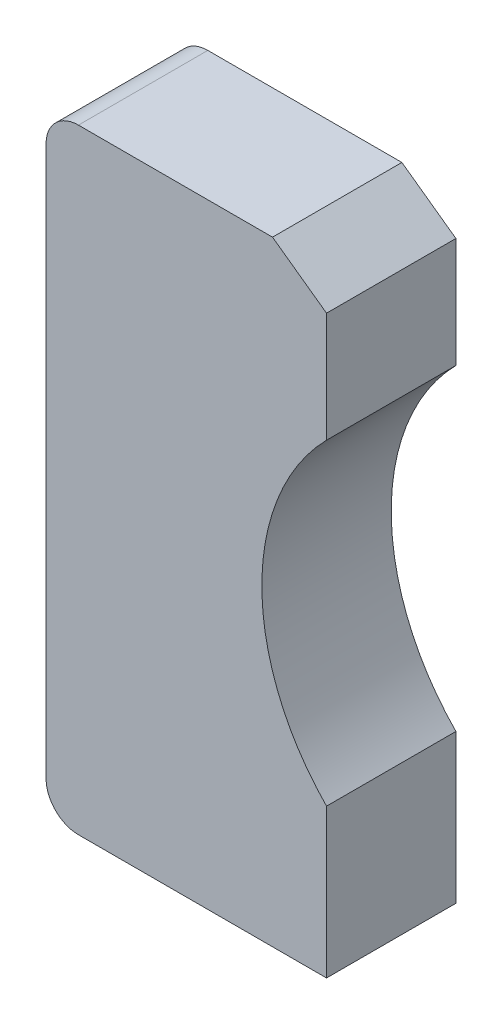
ISO-10303-21;
HEADER;
FILE_DESCRIPTION(('STEP AP214'),'2;1');
FILE_NAME('part.step','',(''),(''),'','','');
FILE_SCHEMA(('AUTOMOTIVE_DESIGN { 1 0 10303 214 1 1 1 1 }'));
ENDSEC;
DATA;
#1=APPLICATION_CONTEXT('core data for automotive mechanical design processes');
#2=APPLICATION_PROTOCOL_DEFINITION('international standard','automotive_design',2000,#1);
#3=PRODUCT_CONTEXT('',#1,'mechanical');
#4=PRODUCT('Part','Part','',(#3));
#5=PRODUCT_RELATED_PRODUCT_CATEGORY('part','',(#4));
#6=PRODUCT_DEFINITION_FORMATION('','',#4);
#7=PRODUCT_DEFINITION_CONTEXT('part definition',#1,'design');
#8=PRODUCT_DEFINITION('design','',#6,#7);
#9=PRODUCT_DEFINITION_SHAPE('','',#8);
#10=(LENGTH_UNIT() NAMED_UNIT(*) SI_UNIT(.MILLI.,.METRE.));
#11=(NAMED_UNIT(*) PLANE_ANGLE_UNIT() SI_UNIT($,.RADIAN.));
#12=(NAMED_UNIT(*) SI_UNIT($,.STERADIAN.) SOLID_ANGLE_UNIT());
#13=UNCERTAINTY_MEASURE_WITH_UNIT(LENGTH_MEASURE(1.E-05),#10,'distance_accuracy_value','');
#14=(GEOMETRIC_REPRESENTATION_CONTEXT(3) GLOBAL_UNCERTAINTY_ASSIGNED_CONTEXT((#13)) GLOBAL_UNIT_ASSIGNED_CONTEXT((#10,
#11,#12)) REPRESENTATION_CONTEXT('',''));
#15=CARTESIAN_POINT('',(0.,0.,0.));
#16=DIRECTION('',(0.,0.,1.));
#17=DIRECTION('',(1.,0.,0.));
#18=AXIS2_PLACEMENT_3D('',#15,#16,#17);
#19=CARTESIAN_POINT('',(-5.95393799901009,4.12312393088872,2.0000001857734));
#20=DIRECTION('',(0.,4.37113882867379E-08,-1.));
#21=DIRECTION('',(0.,1.,4.37113882867379E-08));
#22=AXIS2_PLACEMENT_3D('',#19,#20,#21);
#23=CYLINDRICAL_SURFACE('',#22,0.5);
#24=CARTESIAN_POINT('',(-5.95393799901009,4.1231240183115,1.85773400218636E-07));
#25=DIRECTION('',(0.,4.37113882867379E-08,-1.));
#26=DIRECTION('',(-1.,0.,0.));
#27=AXIS2_PLACEMENT_3D('',#24,#25,#26);
#28=CIRCLE('',#27,0.5);
#29=CARTESIAN_POINT('',(-6.45393799901009,4.1231240183115,1.85773400218636E-07));
#30=VERTEX_POINT('',#29);
#31=CARTESIAN_POINT('',(-5.95393799901009,4.6231240183115,2.07629094362005E-07));
#32=VERTEX_POINT('',#31);
#33=EDGE_CURVE('E11',#30,#32,#28,.T.);
#34=ORIENTED_EDGE('',*,*,#33,.F.);
#35=DIRECTION('',(0.,4.37113882867379E-08,-0.999999999999999));
#36=VECTOR('',#35,1.);
#37=CARTESIAN_POINT('',(-6.45393799901009,4.12312393088872,2.0000001857734));
#38=LINE('',#37,#36);
#39=CARTESIAN_POINT('',(-6.45393799901009,4.12312393088872,2.0000001857734));
#40=VERTEX_POINT('',#39);
#41=EDGE_CURVE('E24',#40,#30,#38,.T.);
#42=ORIENTED_EDGE('',*,*,#41,.F.);
#43=CARTESIAN_POINT('',(-5.95393799901009,4.12312393088872,2.0000001857734));
#44=DIRECTION('',(0.,4.37113882867379E-08,-1.));
#45=DIRECTION('',(-1.,0.,0.));
#46=AXIS2_PLACEMENT_3D('',#43,#44,#45);
#47=CIRCLE('',#46,0.5);
#48=CARTESIAN_POINT('',(-5.95393799901009,4.62312393088872,2.00000020762909));
#49=VERTEX_POINT('',#48);
#50=EDGE_CURVE('E156',#40,#49,#47,.T.);
#51=ORIENTED_EDGE('',*,*,#50,.T.);
#52=DIRECTION('',(0.,4.37113882867379E-08,-0.999999999999999));
#53=VECTOR('',#52,1.);
#54=CARTESIAN_POINT('',(-5.95393799901009,4.62312393088872,2.00000020762909));
#55=LINE('',#54,#53);
#56=EDGE_CURVE('E101',#49,#32,#55,.T.);
#57=ORIENTED_EDGE('',*,*,#56,.T.);
#58=EDGE_LOOP('',(#34,#42,#51,#57));
#59=FACE_BOUND('',#58,.T.);
#60=ADVANCED_FACE('F17',(#59),#23,.T.);
#61=CARTESIAN_POINT('',(-6.45393799901009,-0.126876069111276,2.));
#62=DIRECTION('',(-1.,0.,0.));
#63=DIRECTION('',(0.,-1.,-4.37113882867379E-08));
#64=AXIS2_PLACEMENT_3D('',#61,#62,#63);
#65=PLANE('',#64);
#66=ORIENTED_EDGE('',*,*,#41,.T.);
#67=DIRECTION('',(0.,0.999999999999999,4.37113882867379E-08));
#68=VECTOR('',#67,1.);
#69=CARTESIAN_POINT('',(-6.45393799901009,-4.3768759816885,-1.85773400218636E-07));
#70=LINE('',#69,#68);
#71=CARTESIAN_POINT('',(-6.45393799901009,-4.3768759816885,-1.85773400218636E-07));
#72=VERTEX_POINT('',#71);
#73=EDGE_CURVE('E158',#72,#30,#70,.T.);
#74=ORIENTED_EDGE('',*,*,#73,.F.);
#75=DIRECTION('',(0.,4.37113882867379E-08,-0.999999999999999));
#76=VECTOR('',#75,1.);
#77=CARTESIAN_POINT('',(-6.45393799901009,-4.37687606911128,1.9999998142266));
#78=LINE('',#77,#76);
#79=CARTESIAN_POINT('',(-6.45393799901009,-4.37687606911128,1.9999998142266));
#80=VERTEX_POINT('',#79);
#81=EDGE_CURVE('E148',#80,#72,#78,.T.);
#82=ORIENTED_EDGE('',*,*,#81,.F.);
#83=DIRECTION('',(0.,0.999999999999999,4.37113882867379E-08));
#84=VECTOR('',#83,1.);
#85=CARTESIAN_POINT('',(-6.45393799901009,-4.37687606911128,1.9999998142266));
#86=LINE('',#85,#84);
#87=EDGE_CURVE('E136',#80,#40,#86,.T.);
#88=ORIENTED_EDGE('',*,*,#87,.T.);
#89=EDGE_LOOP('',(#66,#74,#82,#88));
#90=FACE_BOUND('',#89,.T.);
#91=ADVANCED_FACE('F163',(#90),#65,.T.);
#92=CARTESIAN_POINT('',(-5.95393799901009,-4.37687606911128,1.9999998142266));
#93=DIRECTION('',(0.,4.37113882867379E-08,-1.));
#94=DIRECTION('',(0.,1.,4.37113882867379E-08));
#95=AXIS2_PLACEMENT_3D('',#92,#93,#94);
#96=CYLINDRICAL_SURFACE('',#95,0.5);
#97=CARTESIAN_POINT('',(-5.95393799901009,-4.3768759816885,-1.85773400218636E-07));
#98=DIRECTION('',(0.,-4.37113882867379E-08,1.));
#99=DIRECTION('',(-1.,0.,0.));
#100=AXIS2_PLACEMENT_3D('',#97,#98,#99);
#101=CIRCLE('',#100,0.5);
#102=CARTESIAN_POINT('',(-5.95393799901009,-4.8768759816885,-2.07629094362005E-07));
#103=VERTEX_POINT('',#102);
#104=EDGE_CURVE('E161',#72,#103,#101,.T.);
#105=ORIENTED_EDGE('',*,*,#104,.T.);
#106=DIRECTION('',(0.,4.37113882867379E-08,-0.999999999999999));
#107=VECTOR('',#106,1.);
#108=CARTESIAN_POINT('',(-5.95393799901009,-4.87687606911128,1.99999979237091));
#109=LINE('',#108,#107);
#110=CARTESIAN_POINT('',(-5.95393799901009,-4.87687606911128,1.99999979237091));
#111=VERTEX_POINT('',#110);
#112=EDGE_CURVE('E151',#111,#103,#109,.T.);
#113=ORIENTED_EDGE('',*,*,#112,.F.);
#114=CARTESIAN_POINT('',(-5.95393799901009,-4.37687606911128,1.9999998142266));
#115=DIRECTION('',(0.,-4.37113882867379E-08,1.));
#116=DIRECTION('',(-1.,0.,0.));
#117=AXIS2_PLACEMENT_3D('',#114,#115,#116);
#118=CIRCLE('',#117,0.5);
#119=EDGE_CURVE('E138',#80,#111,#118,.T.);
#120=ORIENTED_EDGE('',*,*,#119,.F.);
#121=ORIENTED_EDGE('',*,*,#81,.T.);
#122=EDGE_LOOP('',(#105,#113,#120,#121));
#123=FACE_BOUND('',#122,.T.);
#124=ADVANCED_FACE('F170',(#123),#96,.T.);
#125=CARTESIAN_POINT('',(0.381062000989914,-4.87687606911128,1.99999979237091));
#126=DIRECTION('',(0.,1.,4.37113882867379E-08));
#127=DIRECTION('',(-1.,0.,0.));
#128=AXIS2_PLACEMENT_3D('',#125,#126,#127);
#129=PLANE('',#128);
#130=DIRECTION('',(1.,0.,0.));
#131=VECTOR('',#130,1.);
#132=CARTESIAN_POINT('',(-5.95393799901009,-4.8768759816885,-2.07629094362005E-07));
#133=LINE('',#132,#131);
#134=CARTESIAN_POINT('',(-2.11893799901009,-4.8768759816885,-2.07629094362005E-07));
#135=VERTEX_POINT('',#134);
#136=EDGE_CURVE('E154',#103,#135,#133,.T.);
#137=ORIENTED_EDGE('',*,*,#136,.T.);
#138=DIRECTION('',(0.,4.37113882867379E-08,-0.999999999999999));
#139=VECTOR('',#138,1.);
#140=CARTESIAN_POINT('',(-2.11893799901009,-4.87687606911128,1.99999979237091));
#141=LINE('',#140,#139);
#142=CARTESIAN_POINT('',(-2.11893799901009,-4.87687606911128,1.99999979237091));
#143=VERTEX_POINT('',#142);
#144=EDGE_CURVE('E141',#143,#135,#141,.T.);
#145=ORIENTED_EDGE('',*,*,#144,.F.);
#146=DIRECTION('',(1.,0.,0.));
#147=VECTOR('',#146,1.);
#148=CARTESIAN_POINT('',(-5.95393799901009,-4.87687606911128,1.99999979237091));
#149=LINE('',#148,#147);
#150=EDGE_CURVE('E127',#111,#143,#149,.T.);
#151=ORIENTED_EDGE('',*,*,#150,.F.);
#152=ORIENTED_EDGE('',*,*,#112,.T.);
#153=EDGE_LOOP('',(#137,#145,#151,#152));
#154=FACE_BOUND('',#153,.T.);
#155=ADVANCED_FACE('F174',(#154),#129,.F.);
#156=CARTESIAN_POINT('',(-2.11893799901009,-0.126876069111276,2.));
#157=DIRECTION('',(1.,0.,0.));
#158=DIRECTION('',(0.,1.,4.37113882867379E-08));
#159=AXIS2_PLACEMENT_3D('',#156,#157,#158);
#160=PLANE('',#159);
#161=DIRECTION('',(0.,-0.999999999999999,-4.37113882867379E-08));
#162=VECTOR('',#161,1.);
#163=CARTESIAN_POINT('',(-2.11893799901009,-2.5763657244715,-1.0707059725117E-07));
#164=LINE('',#163,#162);
#165=CARTESIAN_POINT('',(-2.11893799901009,-2.5763657244715,-1.0707059725117E-07));
#166=VERTEX_POINT('',#165);
#167=EDGE_CURVE('E144',#166,#135,#164,.T.);
#168=ORIENTED_EDGE('',*,*,#167,.F.);
#169=DIRECTION('',(0.,4.37113882867379E-08,-0.999999999999999));
#170=VECTOR('',#169,1.);
#171=CARTESIAN_POINT('',(-2.11893799901009,-2.57636581189428,1.9999998929294));
#172=LINE('',#171,#170);
#173=CARTESIAN_POINT('',(-2.11893799901009,-2.57636581189428,1.9999998929294));
#174=VERTEX_POINT('',#173);
#175=EDGE_CURVE('E130',#174,#166,#172,.T.);
#176=ORIENTED_EDGE('',*,*,#175,.F.);
#177=DIRECTION('',(0.,-0.999999999999999,-4.37113882754165E-08));
#178=VECTOR('',#177,1.);
#179=CARTESIAN_POINT('',(-2.11893799901009,-2.57636581189428,1.9999998929294));
#180=LINE('',#179,#178);
#181=EDGE_CURVE('E118',#174,#143,#180,.T.);
#182=ORIENTED_EDGE('',*,*,#181,.T.);
#183=ORIENTED_EDGE('',*,*,#144,.T.);
#184=EDGE_LOOP('',(#168,#176,#182,#183));
#185=FACE_BOUND('',#184,.T.);
#186=ADVANCED_FACE('F181',(#185),#160,.T.);
#187=CARTESIAN_POINT('',(0.38106200098991,-0.126876069111276,2.));
#188=DIRECTION('',(0.,4.37113882867379E-08,-1.));
#189=DIRECTION('',(0.,1.,4.37113882867379E-08));
#190=AXIS2_PLACEMENT_3D('',#187,#188,#189);
#191=CYLINDRICAL_SURFACE('',#190,3.5);
#192=CARTESIAN_POINT('',(0.38106200098991,-0.126875981688499,0.));
#193=DIRECTION('',(0.,-4.37113882867379E-08,1.));
#194=DIRECTION('',(-0.714285714285739,0.69985421222374,3.0591599214621E-08));
#195=AXIS2_PLACEMENT_3D('',#192,#193,#194);
#196=CIRCLE('',#195,3.5);
#197=CARTESIAN_POINT('',(-2.11893799901009,2.3226137610945,1.0707059725117E-07));
#198=VERTEX_POINT('',#197);
#199=EDGE_CURVE('E133',#198,#166,#196,.T.);
#200=ORIENTED_EDGE('',*,*,#199,.F.);
#201=DIRECTION('',(0.,4.37113882867379E-08,-0.999999999999999));
#202=VECTOR('',#201,1.);
#203=CARTESIAN_POINT('',(-2.11893799901009,2.32261367367172,2.0000001070706));
#204=LINE('',#203,#202);
#205=CARTESIAN_POINT('',(-2.11893799901009,2.32261367367172,2.0000001070706));
#206=VERTEX_POINT('',#205);
#207=EDGE_CURVE('E121',#206,#198,#204,.T.);
#208=ORIENTED_EDGE('',*,*,#207,.F.);
#209=CARTESIAN_POINT('',(0.38106200098991,-0.126876069111276,2.));
#210=DIRECTION('',(0.,-4.37113882867379E-08,1.));
#211=DIRECTION('',(-0.714285714285739,0.69985421222374,3.0591599214621E-08));
#212=AXIS2_PLACEMENT_3D('',#209,#210,#211);
#213=CIRCLE('',#212,3.5);
#214=EDGE_CURVE('E112',#206,#174,#213,.T.);
#215=ORIENTED_EDGE('',*,*,#214,.T.);
#216=ORIENTED_EDGE('',*,*,#175,.T.);
#217=EDGE_LOOP('',(#200,#208,#215,#216));
#218=FACE_BOUND('',#217,.T.);
#219=ADVANCED_FACE('F179',(#218),#191,.F.);
#220=CARTESIAN_POINT('',(-2.11893799901009,-0.126876069111276,2.));
#221=DIRECTION('',(1.,0.,0.));
#222=DIRECTION('',(0.,1.,4.37113882867379E-08));
#223=AXIS2_PLACEMENT_3D('',#220,#221,#222);
#224=PLANE('',#223);
#225=DIRECTION('',(0.,-0.999999999999999,-4.37113882867379E-08));
#226=VECTOR('',#225,1.);
#227=CARTESIAN_POINT('',(-2.11893799901009,4.0231240183115,1.81402261389962E-07));
#228=LINE('',#227,#226);
#229=CARTESIAN_POINT('',(-2.11893799901009,4.0231240183115,1.81402261389962E-07));
#230=VERTEX_POINT('',#229);
#231=EDGE_CURVE('E124',#230,#198,#228,.T.);
#232=ORIENTED_EDGE('',*,*,#231,.F.);
#233=DIRECTION('',(0.,4.37113882867379E-08,-0.999999999999999));
#234=VECTOR('',#233,1.);
#235=CARTESIAN_POINT('',(-2.11893799901009,4.02312393088872,2.00000018140226));
#236=LINE('',#235,#234);
#237=CARTESIAN_POINT('',(-2.11893799901009,4.02312393088872,2.00000018140226));
#238=VERTEX_POINT('',#237);
#239=EDGE_CURVE('E115',#238,#230,#236,.T.);
#240=ORIENTED_EDGE('',*,*,#239,.F.);
#241=DIRECTION('',(0.,-0.999999999999999,-4.37113881669616E-08));
#242=VECTOR('',#241,1.);
#243=CARTESIAN_POINT('',(-2.11893799901009,4.02312393088872,2.00000018140226));
#244=LINE('',#243,#242);
#245=EDGE_CURVE('E95',#238,#206,#244,.T.);
#246=ORIENTED_EDGE('',*,*,#245,.T.);
#247=ORIENTED_EDGE('',*,*,#207,.T.);
#248=EDGE_LOOP('',(#232,#240,#246,#247));
#249=FACE_BOUND('',#248,.T.);
#250=ADVANCED_FACE('F177',(#249),#224,.T.);
#251=CARTESIAN_POINT('',(1.49638749934691,1.42528524943472,2.00000006784713));
#252=DIRECTION('',(0.583535844379755,0.812087383428659,3.54974669398112E-08));
#253=DIRECTION('',(-0.812087383428659,0.583535844379755,2.5507161872913E-08));
#254=AXIS2_PLACEMENT_3D('',#251,#252,#253);
#255=PLANE('',#254);
#256=DIRECTION('',(0.812087383428658,-0.583535844379756,-2.5507161872913E-08));
#257=VECTOR('',#256,1.);
#258=CARTESIAN_POINT('',(-2.95393799901033,4.62312401831115,2.0762909436199E-07));
#259=LINE('',#258,#257);
#260=CARTESIAN_POINT('',(-2.95393799901009,4.6231240183115,2.07629094362005E-07));
#261=VERTEX_POINT('',#260);
#262=EDGE_CURVE('E90',#261,#230,#259,.T.);
#263=ORIENTED_EDGE('',*,*,#262,.F.);
#264=DIRECTION('',(0.,4.37113882867379E-08,-0.999999999999999));
#265=VECTOR('',#264,1.);
#266=CARTESIAN_POINT('',(-2.95393799901009,4.62312393088872,2.00000020762909));
#267=LINE('',#266,#265);
#268=CARTESIAN_POINT('',(-2.95393799901009,4.62312393088872,2.00000020762909));
#269=VERTEX_POINT('',#268);
#270=EDGE_CURVE('E82',#269,#261,#267,.T.);
#271=ORIENTED_EDGE('',*,*,#270,.F.);
#272=DIRECTION('',(0.812087383428658,-0.583535844379756,-2.55071620456777E-08));
#273=VECTOR('',#272,1.);
#274=CARTESIAN_POINT('',(-2.95393799901033,4.62312393088838,2.00000020762909));
#275=LINE('',#274,#273);
#276=EDGE_CURVE('E87',#269,#238,#275,.T.);
#277=ORIENTED_EDGE('',*,*,#276,.T.);
#278=ORIENTED_EDGE('',*,*,#239,.T.);
#279=EDGE_LOOP('',(#263,#271,#277,#278));
#280=FACE_BOUND('',#279,.T.);
#281=ADVANCED_FACE('F84',(#280),#255,.T.);
#282=CARTESIAN_POINT('',(0.381062000989914,4.62312393088872,2.00000020762909));
#283=DIRECTION('',(0.,1.,4.37113882867379E-08));
#284=DIRECTION('',(-1.,0.,0.));
#285=AXIS2_PLACEMENT_3D('',#282,#283,#284);
#286=PLANE('',#285);
#287=DIRECTION('',(1.,0.,0.));
#288=VECTOR('',#287,1.);
#289=CARTESIAN_POINT('',(-5.95393799901009,4.6231240183115,2.07629094362005E-07));
#290=LINE('',#289,#288);
#291=EDGE_CURVE('E94',#32,#261,#290,.T.);
#292=ORIENTED_EDGE('',*,*,#291,.F.);
#293=ORIENTED_EDGE('',*,*,#56,.F.);
#294=DIRECTION('',(1.,0.,0.));
#295=VECTOR('',#294,1.);
#296=CARTESIAN_POINT('',(-5.95393799901009,4.62312393088872,2.00000020762909));
#297=LINE('',#296,#295);
#298=EDGE_CURVE('E99',#49,#269,#297,.T.);
#299=ORIENTED_EDGE('',*,*,#298,.T.);
#300=ORIENTED_EDGE('',*,*,#270,.T.);
#301=EDGE_LOOP('',(#292,#293,#299,#300));
#302=FACE_BOUND('',#301,.T.);
#303=ADVANCED_FACE('F100',(#302),#286,.T.);
#304=CARTESIAN_POINT('',(0.381062000989914,-0.126876069111276,2.));
#305=DIRECTION('',(0.,-4.37113882867379E-08,1.));
#306=DIRECTION('',(0.,-1.,-4.37113882867379E-08));
#307=AXIS2_PLACEMENT_3D('',#304,#305,#306);
#308=PLANE('',#307);
#309=ORIENTED_EDGE('',*,*,#50,.F.);
#310=ORIENTED_EDGE('',*,*,#87,.F.);
#311=ORIENTED_EDGE('',*,*,#119,.T.);
#312=ORIENTED_EDGE('',*,*,#150,.T.);
#313=ORIENTED_EDGE('',*,*,#181,.F.);
#314=ORIENTED_EDGE('',*,*,#214,.F.);
#315=ORIENTED_EDGE('',*,*,#245,.F.);
#316=ORIENTED_EDGE('',*,*,#276,.F.);
#317=ORIENTED_EDGE('',*,*,#298,.F.);
#318=EDGE_LOOP('',(#309,#310,#311,#312,#313,#314,#315,#316,#317));
#319=FACE_BOUND('',#318,.T.);
#320=ADVANCED_FACE('F105',(#319),#308,.T.);
#321=CARTESIAN_POINT('',(0.381062000989914,-0.126875981688499,0.));
#322=DIRECTION('',(0.,-4.37113882867379E-08,1.));
#323=DIRECTION('',(0.,-1.,-4.37113882867379E-08));
#324=AXIS2_PLACEMENT_3D('',#321,#322,#323);
#325=PLANE('',#324);
#326=ORIENTED_EDGE('',*,*,#33,.T.);
#327=ORIENTED_EDGE('',*,*,#291,.T.);
#328=ORIENTED_EDGE('',*,*,#262,.T.);
#329=ORIENTED_EDGE('',*,*,#231,.T.);
#330=ORIENTED_EDGE('',*,*,#199,.T.);
#331=ORIENTED_EDGE('',*,*,#167,.T.);
#332=ORIENTED_EDGE('',*,*,#136,.F.);
#333=ORIENTED_EDGE('',*,*,#104,.F.);
#334=ORIENTED_EDGE('',*,*,#73,.T.);
#335=EDGE_LOOP('',(#326,#327,#328,#329,#330,#331,#332,#333,#334));
#336=FACE_BOUND('',#335,.T.);
#337=ADVANCED_FACE('F167',(#336),#325,.F.);
#338=CLOSED_SHELL('',(#60,#91,#124,#155,#186,#219,#250,#281,#303,#320,#337));
#339=MANIFOLD_SOLID_BREP('B1',#338);
#340=ADVANCED_BREP_SHAPE_REPRESENTATION('',(#18,#339),#14);
#341=SHAPE_DEFINITION_REPRESENTATION(#9,#340);
ENDSEC;
END-ISO-10303-21;
